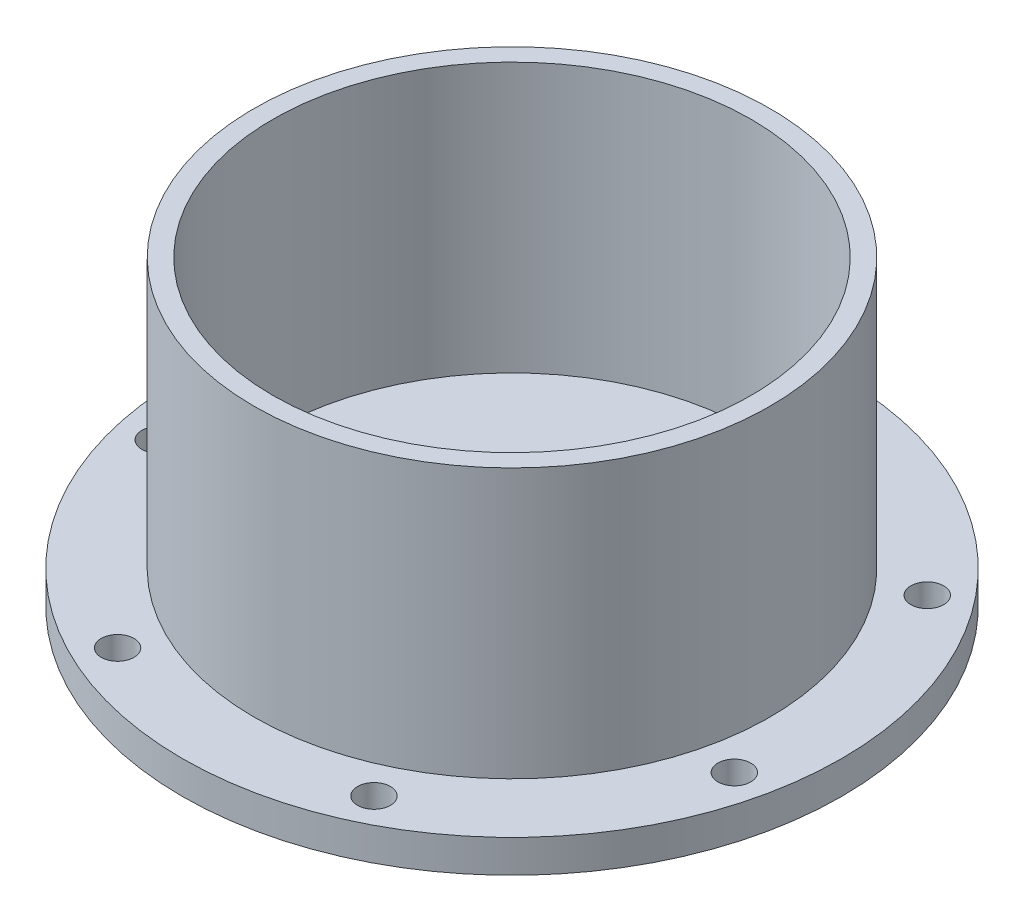
ISO-10303-21;
HEADER;
FILE_DESCRIPTION(('STEP AP214'),'2;1');
FILE_NAME('part.step','',(''),(''),'','','');
FILE_SCHEMA(('AUTOMOTIVE_DESIGN { 1 0 10303 214 1 1 1 1 }'));
ENDSEC;
DATA;
#1=APPLICATION_CONTEXT('core data for automotive mechanical design processes');
#2=APPLICATION_PROTOCOL_DEFINITION('international standard','automotive_design',2000,#1);
#3=PRODUCT_CONTEXT('',#1,'mechanical');
#4=PRODUCT('Part','Part','',(#3));
#5=PRODUCT_RELATED_PRODUCT_CATEGORY('part','',(#4));
#6=PRODUCT_DEFINITION_FORMATION('','',#4);
#7=PRODUCT_DEFINITION_CONTEXT('part definition',#1,'design');
#8=PRODUCT_DEFINITION('design','',#6,#7);
#9=PRODUCT_DEFINITION_SHAPE('','',#8);
#10=(LENGTH_UNIT() NAMED_UNIT(*) SI_UNIT(.MILLI.,.METRE.));
#11=(NAMED_UNIT(*) PLANE_ANGLE_UNIT() SI_UNIT($,.RADIAN.));
#12=(NAMED_UNIT(*) SI_UNIT($,.STERADIAN.) SOLID_ANGLE_UNIT());
#13=UNCERTAINTY_MEASURE_WITH_UNIT(LENGTH_MEASURE(1.E-05),#10,'distance_accuracy_value','');
#14=(GEOMETRIC_REPRESENTATION_CONTEXT(3) GLOBAL_UNCERTAINTY_ASSIGNED_CONTEXT((#13)) GLOBAL_UNIT_ASSIGNED_CONTEXT((#10,
#11,#12)) REPRESENTATION_CONTEXT('',''));
#15=CARTESIAN_POINT('',(0.,0.,0.));
#16=DIRECTION('',(0.,0.,1.));
#17=DIRECTION('',(1.,0.,0.));
#18=AXIS2_PLACEMENT_3D('',#15,#16,#17);
#19=CARTESIAN_POINT('',(0.,3.5,0.));
#20=DIRECTION('',(0.,1.,0.));
#21=DIRECTION('',(0.,0.,1.));
#22=AXIS2_PLACEMENT_3D('',#19,#20,#21);
#23=PLANE('',#22);
#24=CARTESIAN_POINT('',(0.,3.5,0.));
#25=DIRECTION('',(0.,1.,0.));
#26=DIRECTION('',(0.,0.,1.));
#27=AXIS2_PLACEMENT_3D('',#24,#25,#26);
#28=CIRCLE('',#27,27.5);
#29=CARTESIAN_POINT('',(0.,3.5,27.5));
#30=VERTEX_POINT('',#29);
#31=EDGE_CURVE('E114',#30,#30,#28,.T.);
#32=ORIENTED_EDGE('',*,*,#31,.F.);
#33=EDGE_LOOP('',(#32));
#34=FACE_BOUND('',#33,.T.);
#35=CARTESIAN_POINT('',(-30.7102292337274,3.5,7.00940941962391));
#36=DIRECTION('',(0.,1.,0.));
#37=DIRECTION('',(0.,0.,1.));
#38=AXIS2_PLACEMENT_3D('',#35,#36,#37);
#39=CIRCLE('',#38,1.75000000000029);
#40=CARTESIAN_POINT('',(-30.7102292337274,3.5,8.7594094196242));
#41=VERTEX_POINT('',#40);
#42=EDGE_CURVE('E94',#41,#41,#39,.T.);
#43=ORIENTED_EDGE('',*,*,#42,.F.);
#44=EDGE_LOOP('',(#43));
#45=FACE_BOUND('',#44,.T.);
#46=CARTESIAN_POINT('',(13.6673377822031,3.5,28.3805193389262));
#47=DIRECTION('',(0.,1.,0.));
#48=DIRECTION('',(0.,0.,1.));
#49=AXIS2_PLACEMENT_3D('',#46,#47,#48);
#50=CIRCLE('',#49,1.75000000000019);
#51=CARTESIAN_POINT('',(13.6673377822031,3.5,30.1305193389264));
#52=VERTEX_POINT('',#51);
#53=EDGE_CURVE('E78',#52,#52,#50,.T.);
#54=ORIENTED_EDGE('',*,*,#53,.F.);
#55=EDGE_LOOP('',(#54));
#56=FACE_BOUND('',#55,.T.);
#57=CARTESIAN_POINT('',(24.6276916977429,3.5,-19.6399287585501));
#58=DIRECTION('',(0.,1.,0.));
#59=DIRECTION('',(0.,0.,1.));
#60=AXIS2_PLACEMENT_3D('',#57,#58,#59);
#61=CIRCLE('',#60,1.75000000000006);
#62=CARTESIAN_POINT('',(24.6276916977429,3.5,-17.8899287585501));
#63=VERTEX_POINT('',#62);
#64=EDGE_CURVE('E62',#63,#63,#61,.T.);
#65=ORIENTED_EDGE('',*,*,#64,.F.);
#66=EDGE_LOOP('',(#65));
#67=FACE_BOUND('',#66,.T.);
#68=CARTESIAN_POINT('',(0.,3.5,0.));
#69=DIRECTION('',(0.,1.,0.));
#70=DIRECTION('',(0.,0.,1.));
#71=AXIS2_PLACEMENT_3D('',#68,#69,#70);
#72=CIRCLE('',#71,35.15);
#73=CARTESIAN_POINT('',(0.,3.5,35.15));
#74=VERTEX_POINT('',#73);
#75=EDGE_CURVE('E45',#74,#74,#72,.T.);
#76=ORIENTED_EDGE('',*,*,#75,.T.);
#77=EDGE_LOOP('',(#76));
#78=FACE_BOUND('',#77,.T.);
#79=CARTESIAN_POINT('',(0.,3.5,-31.5));
#80=DIRECTION('',(0.,1.,0.));
#81=DIRECTION('',(0.,0.,1.));
#82=AXIS2_PLACEMENT_3D('',#79,#80,#81);
#83=CIRCLE('',#82,1.75);
#84=CARTESIAN_POINT('',(0.,3.5,-29.75));
#85=VERTEX_POINT('',#84);
#86=EDGE_CURVE('E56',#85,#85,#83,.T.);
#87=ORIENTED_EDGE('',*,*,#86,.F.);
#88=EDGE_LOOP('',(#87));
#89=FACE_BOUND('',#88,.T.);
#90=CARTESIAN_POINT('',(30.7102292337274,3.5,7.0094094196239));
#91=DIRECTION('',(0.,1.,0.));
#92=DIRECTION('',(0.,0.,1.));
#93=AXIS2_PLACEMENT_3D('',#90,#91,#92);
#94=CIRCLE('',#93,1.75000000000012);
#95=CARTESIAN_POINT('',(30.7102292337274,3.5,8.75940941962402));
#96=VERTEX_POINT('',#95);
#97=EDGE_CURVE('E70',#96,#96,#94,.T.);
#98=ORIENTED_EDGE('',*,*,#97,.F.);
#99=EDGE_LOOP('',(#98));
#100=FACE_BOUND('',#99,.T.);
#101=CARTESIAN_POINT('',(-13.6673377822031,3.5,28.3805193389262));
#102=DIRECTION('',(0.,1.,0.));
#103=DIRECTION('',(0.,0.,1.));
#104=AXIS2_PLACEMENT_3D('',#101,#102,#103);
#105=CIRCLE('',#104,1.75000000000024);
#106=CARTESIAN_POINT('',(-13.6673377822031,3.5,30.1305193389264));
#107=VERTEX_POINT('',#106);
#108=EDGE_CURVE('E86',#107,#107,#105,.T.);
#109=ORIENTED_EDGE('',*,*,#108,.F.);
#110=EDGE_LOOP('',(#109));
#111=FACE_BOUND('',#110,.T.);
#112=CARTESIAN_POINT('',(-24.6276916977429,3.5,-19.6399287585501));
#113=DIRECTION('',(0.,1.,0.));
#114=DIRECTION('',(0.,0.,1.));
#115=AXIS2_PLACEMENT_3D('',#112,#113,#114);
#116=CIRCLE('',#115,1.75000000000037);
#117=CARTESIAN_POINT('',(-24.6276916977429,3.5,-17.8899287585497));
#118=VERTEX_POINT('',#117);
#119=EDGE_CURVE('E102',#118,#118,#116,.T.);
#120=ORIENTED_EDGE('',*,*,#119,.F.);
#121=EDGE_LOOP('',(#120));
#122=FACE_BOUND('',#121,.T.);
#123=ADVANCED_FACE('F37',(#34,#45,#56,#67,#78,#89,#100,#111,#122),#23,.T.);
#124=CARTESIAN_POINT('',(0.,0.,0.));
#125=DIRECTION('',(0.,1.,0.));
#126=DIRECTION('',(0.,0.,1.));
#127=AXIS2_PLACEMENT_3D('',#124,#125,#126);
#128=PLANE('',#127);
#129=CARTESIAN_POINT('',(0.,0.,0.));
#130=DIRECTION('',(0.,1.,0.));
#131=DIRECTION('',(0.,0.,1.));
#132=AXIS2_PLACEMENT_3D('',#129,#130,#131);
#133=CIRCLE('',#132,35.15);
#134=CARTESIAN_POINT('',(0.,0.,35.15));
#135=VERTEX_POINT('',#134);
#136=EDGE_CURVE('E50',#135,#135,#133,.T.);
#137=ORIENTED_EDGE('',*,*,#136,.F.);
#138=EDGE_LOOP('',(#137));
#139=FACE_BOUND('',#138,.T.);
#140=CARTESIAN_POINT('',(0.,0.,-31.5));
#141=DIRECTION('',(0.,1.,0.));
#142=DIRECTION('',(0.,0.,1.));
#143=AXIS2_PLACEMENT_3D('',#140,#141,#142);
#144=CIRCLE('',#143,1.75);
#145=CARTESIAN_POINT('',(0.,0.,-29.75));
#146=VERTEX_POINT('',#145);
#147=EDGE_CURVE('E58',#146,#146,#144,.T.);
#148=ORIENTED_EDGE('',*,*,#147,.T.);
#149=EDGE_LOOP('',(#148));
#150=FACE_BOUND('',#149,.T.);
#151=CARTESIAN_POINT('',(24.6276916977429,0.,-19.6399287585501));
#152=DIRECTION('',(0.,1.,0.));
#153=DIRECTION('',(0.,0.,1.));
#154=AXIS2_PLACEMENT_3D('',#151,#152,#153);
#155=CIRCLE('',#154,1.75000000000006);
#156=CARTESIAN_POINT('',(24.6276916977429,0.,-17.8899287585501));
#157=VERTEX_POINT('',#156);
#158=EDGE_CURVE('E66',#157,#157,#155,.T.);
#159=ORIENTED_EDGE('',*,*,#158,.T.);
#160=EDGE_LOOP('',(#159));
#161=FACE_BOUND('',#160,.T.);
#162=CARTESIAN_POINT('',(30.7102292337274,0.,7.0094094196239));
#163=DIRECTION('',(0.,1.,0.));
#164=DIRECTION('',(0.,0.,1.));
#165=AXIS2_PLACEMENT_3D('',#162,#163,#164);
#166=CIRCLE('',#165,1.75000000000012);
#167=CARTESIAN_POINT('',(30.7102292337274,0.,8.75940941962402));
#168=VERTEX_POINT('',#167);
#169=EDGE_CURVE('E74',#168,#168,#166,.T.);
#170=ORIENTED_EDGE('',*,*,#169,.T.);
#171=EDGE_LOOP('',(#170));
#172=FACE_BOUND('',#171,.T.);
#173=CARTESIAN_POINT('',(13.6673377822031,0.,28.3805193389262));
#174=DIRECTION('',(0.,1.,0.));
#175=DIRECTION('',(0.,0.,1.));
#176=AXIS2_PLACEMENT_3D('',#173,#174,#175);
#177=CIRCLE('',#176,1.75000000000019);
#178=CARTESIAN_POINT('',(13.6673377822031,0.,30.1305193389264));
#179=VERTEX_POINT('',#178);
#180=EDGE_CURVE('E82',#179,#179,#177,.T.);
#181=ORIENTED_EDGE('',*,*,#180,.T.);
#182=EDGE_LOOP('',(#181));
#183=FACE_BOUND('',#182,.T.);
#184=CARTESIAN_POINT('',(-13.6673377822031,0.,28.3805193389262));
#185=DIRECTION('',(0.,1.,0.));
#186=DIRECTION('',(0.,0.,1.));
#187=AXIS2_PLACEMENT_3D('',#184,#185,#186);
#188=CIRCLE('',#187,1.75000000000024);
#189=CARTESIAN_POINT('',(-13.6673377822031,0.,30.1305193389264));
#190=VERTEX_POINT('',#189);
#191=EDGE_CURVE('E90',#190,#190,#188,.T.);
#192=ORIENTED_EDGE('',*,*,#191,.T.);
#193=EDGE_LOOP('',(#192));
#194=FACE_BOUND('',#193,.T.);
#195=CARTESIAN_POINT('',(-30.7102292337274,0.,7.00940941962391));
#196=DIRECTION('',(0.,1.,0.));
#197=DIRECTION('',(0.,0.,1.));
#198=AXIS2_PLACEMENT_3D('',#195,#196,#197);
#199=CIRCLE('',#198,1.75000000000029);
#200=CARTESIAN_POINT('',(-30.7102292337274,0.,8.7594094196242));
#201=VERTEX_POINT('',#200);
#202=EDGE_CURVE('E98',#201,#201,#199,.T.);
#203=ORIENTED_EDGE('',*,*,#202,.T.);
#204=EDGE_LOOP('',(#203));
#205=FACE_BOUND('',#204,.T.);
#206=CARTESIAN_POINT('',(-24.6276916977429,0.,-19.6399287585501));
#207=DIRECTION('',(0.,1.,0.));
#208=DIRECTION('',(0.,0.,1.));
#209=AXIS2_PLACEMENT_3D('',#206,#207,#208);
#210=CIRCLE('',#209,1.75000000000037);
#211=CARTESIAN_POINT('',(-24.6276916977429,0.,-17.8899287585497));
#212=VERTEX_POINT('',#211);
#213=EDGE_CURVE('E106',#212,#212,#210,.T.);
#214=ORIENTED_EDGE('',*,*,#213,.T.);
#215=EDGE_LOOP('',(#214));
#216=FACE_BOUND('',#215,.T.);
#217=ADVANCED_FACE('F145',(#139,#150,#161,#172,#183,#194,#205,#216),#128,.F.);
#218=CARTESIAN_POINT('',(0.,3.5,0.));
#219=DIRECTION('',(0.,-1.,0.));
#220=DIRECTION('',(0.,0.,-1.));
#221=AXIS2_PLACEMENT_3D('',#218,#219,#220);
#222=CYLINDRICAL_SURFACE('',#221,35.15);
#223=ORIENTED_EDGE('',*,*,#75,.F.);
#224=EDGE_LOOP('',(#223));
#225=FACE_BOUND('',#224,.T.);
#226=ORIENTED_EDGE('',*,*,#136,.T.);
#227=EDGE_LOOP('',(#226));
#228=FACE_BOUND('',#227,.T.);
#229=ADVANCED_FACE('F39',(#225,#228),#222,.T.);
#230=CARTESIAN_POINT('',(0.,3.5,-31.5));
#231=DIRECTION('',(0.,-1.,0.));
#232=DIRECTION('',(0.,0.,-1.));
#233=AXIS2_PLACEMENT_3D('',#230,#231,#232);
#234=CYLINDRICAL_SURFACE('',#233,1.75);
#235=ORIENTED_EDGE('',*,*,#86,.T.);
#236=EDGE_LOOP('',(#235));
#237=FACE_BOUND('',#236,.T.);
#238=ORIENTED_EDGE('',*,*,#147,.F.);
#239=EDGE_LOOP('',(#238));
#240=FACE_BOUND('',#239,.T.);
#241=ADVANCED_FACE('F232',(#237,#240),#234,.F.);
#242=CARTESIAN_POINT('',(24.6276916977429,3.5,-19.6399287585501));
#243=DIRECTION('',(0.,-1.,0.));
#244=DIRECTION('',(0.,0.,-1.));
#245=AXIS2_PLACEMENT_3D('',#242,#243,#244);
#246=CYLINDRICAL_SURFACE('',#245,1.75000000000006);
#247=ORIENTED_EDGE('',*,*,#64,.T.);
#248=EDGE_LOOP('',(#247));
#249=FACE_BOUND('',#248,.T.);
#250=ORIENTED_EDGE('',*,*,#158,.F.);
#251=EDGE_LOOP('',(#250));
#252=FACE_BOUND('',#251,.T.);
#253=ADVANCED_FACE('F222',(#249,#252),#246,.F.);
#254=CARTESIAN_POINT('',(30.7102292337274,3.5,7.0094094196239));
#255=DIRECTION('',(0.,-1.,0.));
#256=DIRECTION('',(0.,0.,-1.));
#257=AXIS2_PLACEMENT_3D('',#254,#255,#256);
#258=CYLINDRICAL_SURFACE('',#257,1.75000000000012);
#259=ORIENTED_EDGE('',*,*,#97,.T.);
#260=EDGE_LOOP('',(#259));
#261=FACE_BOUND('',#260,.T.);
#262=ORIENTED_EDGE('',*,*,#169,.F.);
#263=EDGE_LOOP('',(#262));
#264=FACE_BOUND('',#263,.T.);
#265=ADVANCED_FACE('F212',(#261,#264),#258,.F.);
#266=CARTESIAN_POINT('',(13.6673377822031,3.5,28.3805193389262));
#267=DIRECTION('',(0.,-1.,0.));
#268=DIRECTION('',(0.,0.,-1.));
#269=AXIS2_PLACEMENT_3D('',#266,#267,#268);
#270=CYLINDRICAL_SURFACE('',#269,1.75000000000019);
#271=ORIENTED_EDGE('',*,*,#53,.T.);
#272=EDGE_LOOP('',(#271));
#273=FACE_BOUND('',#272,.T.);
#274=ORIENTED_EDGE('',*,*,#180,.F.);
#275=EDGE_LOOP('',(#274));
#276=FACE_BOUND('',#275,.T.);
#277=ADVANCED_FACE('F202',(#273,#276),#270,.F.);
#278=CARTESIAN_POINT('',(-13.6673377822031,3.5,28.3805193389262));
#279=DIRECTION('',(0.,-1.,0.));
#280=DIRECTION('',(0.,0.,-1.));
#281=AXIS2_PLACEMENT_3D('',#278,#279,#280);
#282=CYLINDRICAL_SURFACE('',#281,1.75000000000024);
#283=ORIENTED_EDGE('',*,*,#108,.T.);
#284=EDGE_LOOP('',(#283));
#285=FACE_BOUND('',#284,.T.);
#286=ORIENTED_EDGE('',*,*,#191,.F.);
#287=EDGE_LOOP('',(#286));
#288=FACE_BOUND('',#287,.T.);
#289=ADVANCED_FACE('F192',(#285,#288),#282,.F.);
#290=CARTESIAN_POINT('',(-30.7102292337274,3.5,7.00940941962391));
#291=DIRECTION('',(0.,-1.,0.));
#292=DIRECTION('',(0.,0.,-1.));
#293=AXIS2_PLACEMENT_3D('',#290,#291,#292);
#294=CYLINDRICAL_SURFACE('',#293,1.75000000000029);
#295=ORIENTED_EDGE('',*,*,#42,.T.);
#296=EDGE_LOOP('',(#295));
#297=FACE_BOUND('',#296,.T.);
#298=ORIENTED_EDGE('',*,*,#202,.F.);
#299=EDGE_LOOP('',(#298));
#300=FACE_BOUND('',#299,.T.);
#301=ADVANCED_FACE('F140',(#297,#300),#294,.F.);
#302=CARTESIAN_POINT('',(-24.6276916977429,3.5,-19.6399287585501));
#303=DIRECTION('',(0.,-1.,0.));
#304=DIRECTION('',(0.,0.,-1.));
#305=AXIS2_PLACEMENT_3D('',#302,#303,#304);
#306=CYLINDRICAL_SURFACE('',#305,1.75000000000037);
#307=ORIENTED_EDGE('',*,*,#119,.T.);
#308=EDGE_LOOP('',(#307));
#309=FACE_BOUND('',#308,.T.);
#310=ORIENTED_EDGE('',*,*,#213,.F.);
#311=EDGE_LOOP('',(#310));
#312=FACE_BOUND('',#311,.T.);
#313=ADVANCED_FACE('F131',(#309,#312),#306,.F.);
#314=CARTESIAN_POINT('',(0.,32.2,0.));
#315=DIRECTION('',(0.,1.,0.));
#316=DIRECTION('',(0.,0.,1.));
#317=AXIS2_PLACEMENT_3D('',#314,#315,#316);
#318=PLANE('',#317);
#319=CARTESIAN_POINT('',(0.,32.2,0.));
#320=DIRECTION('',(0.,1.,0.));
#321=DIRECTION('',(0.,0.,1.));
#322=AXIS2_PLACEMENT_3D('',#319,#320,#321);
#323=CIRCLE('',#322,27.5);
#324=CARTESIAN_POINT('',(0.,32.2,27.5));
#325=VERTEX_POINT('',#324);
#326=EDGE_CURVE('E110',#325,#325,#323,.T.);
#327=ORIENTED_EDGE('',*,*,#326,.T.);
#328=EDGE_LOOP('',(#327));
#329=FACE_BOUND('',#328,.T.);
#330=CARTESIAN_POINT('',(0.,32.2,0.));
#331=DIRECTION('',(0.,1.,0.));
#332=DIRECTION('',(0.,0.,1.));
#333=AXIS2_PLACEMENT_3D('',#330,#331,#332);
#334=CIRCLE('',#333,25.5);
#335=CARTESIAN_POINT('',(0.,32.2,25.5));
#336=VERTEX_POINT('',#335);
#337=EDGE_CURVE('E118',#336,#336,#334,.T.);
#338=ORIENTED_EDGE('',*,*,#337,.F.);
#339=EDGE_LOOP('',(#338));
#340=FACE_BOUND('',#339,.T.);
#341=ADVANCED_FACE('F128',(#329,#340),#318,.T.);
#342=CARTESIAN_POINT('',(0.,32.2,0.));
#343=DIRECTION('',(0.,-1.,0.));
#344=DIRECTION('',(0.,0.,-1.));
#345=AXIS2_PLACEMENT_3D('',#342,#343,#344);
#346=CYLINDRICAL_SURFACE('',#345,27.5);
#347=ORIENTED_EDGE('',*,*,#326,.F.);
#348=EDGE_LOOP('',(#347));
#349=FACE_BOUND('',#348,.T.);
#350=ORIENTED_EDGE('',*,*,#31,.T.);
#351=EDGE_LOOP('',(#350));
#352=FACE_BOUND('',#351,.T.);
#353=ADVANCED_FACE('F130',(#349,#352),#346,.T.);
#354=CARTESIAN_POINT('',(0.,32.2,0.));
#355=DIRECTION('',(0.,-1.,0.));
#356=DIRECTION('',(0.,0.,-1.));
#357=AXIS2_PLACEMENT_3D('',#354,#355,#356);
#358=CYLINDRICAL_SURFACE('',#357,25.5);
#359=ORIENTED_EDGE('',*,*,#337,.T.);
#360=EDGE_LOOP('',(#359));
#361=FACE_BOUND('',#360,.T.);
#362=CARTESIAN_POINT('',(0.,3.5,0.));
#363=DIRECTION('',(0.,1.,0.));
#364=DIRECTION('',(0.,0.,1.));
#365=AXIS2_PLACEMENT_3D('',#362,#363,#364);
#366=CIRCLE('',#365,25.5);
#367=CARTESIAN_POINT('',(0.,3.5,25.5));
#368=VERTEX_POINT('',#367);
#369=EDGE_CURVE('E10',#368,#368,#366,.F.);
#370=ORIENTED_EDGE('',*,*,#369,.T.);
#371=EDGE_LOOP('',(#370));
#372=FACE_BOUND('',#371,.T.);
#373=ADVANCED_FACE('F126',(#361,#372),#358,.F.);
#374=ORIENTED_EDGE('',*,*,#369,.F.);
#375=EDGE_LOOP('',(#374));
#376=FACE_BOUND('',#375,.T.);
#377=ADVANCED_FACE('F148',(#376),#23,.T.);
#378=CLOSED_SHELL('',(#123,#217,#229,#241,#253,#265,#277,#289,#301,#313,#341,#353,#373,#377));
#379=MANIFOLD_SOLID_BREP('B2',#378);
#380=ADVANCED_BREP_SHAPE_REPRESENTATION('',(#18,#379),#14);
#381=SHAPE_DEFINITION_REPRESENTATION(#9,#380);
ENDSEC;
END-ISO-10303-21;
